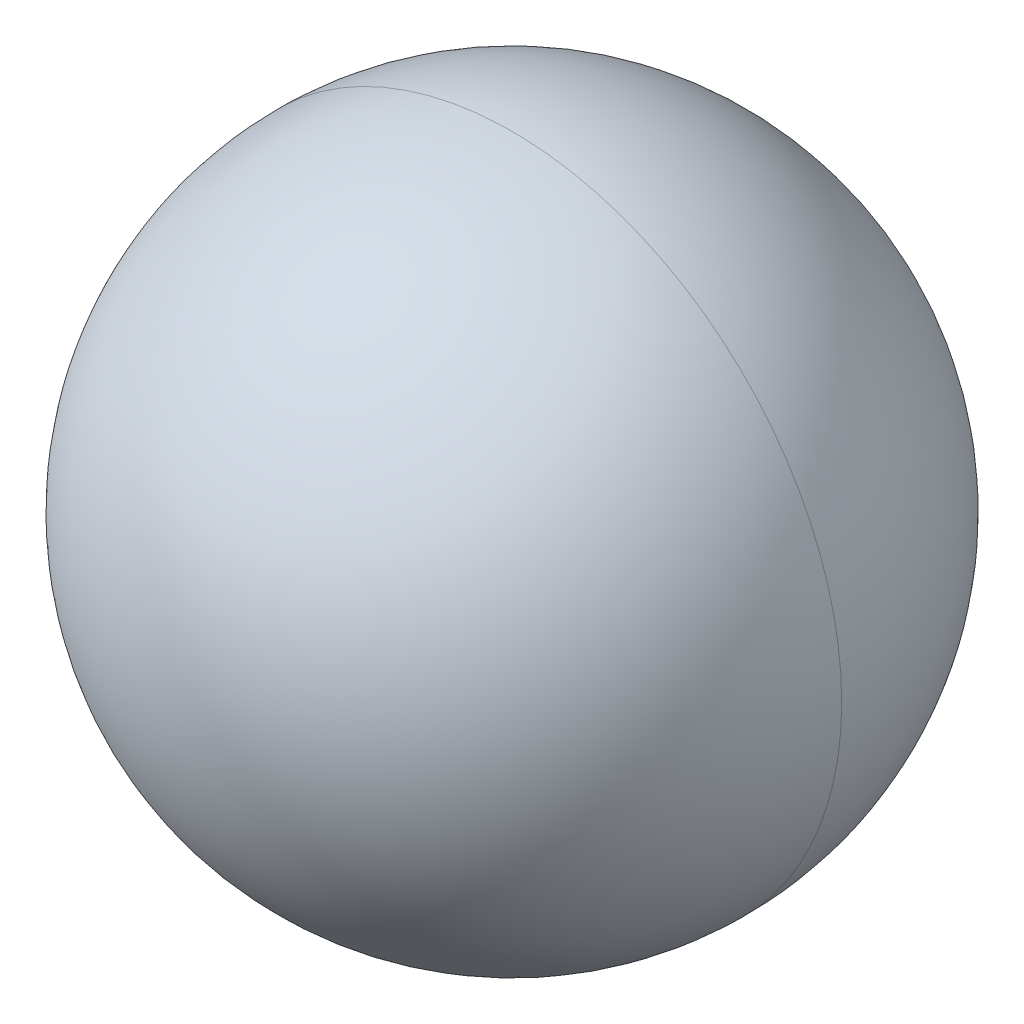
ISO-10303-21;
HEADER;
FILE_DESCRIPTION(('STEP AP214'),'2;1');
FILE_NAME('part.step','',(''),(''),'','','');
FILE_SCHEMA(('AUTOMOTIVE_DESIGN { 1 0 10303 214 1 1 1 1 }'));
ENDSEC;
DATA;
#1=APPLICATION_CONTEXT('core data for automotive mechanical design processes');
#2=APPLICATION_PROTOCOL_DEFINITION('international standard','automotive_design',2000,#1);
#3=PRODUCT_CONTEXT('',#1,'mechanical');
#4=PRODUCT('Part','Part','',(#3));
#5=PRODUCT_RELATED_PRODUCT_CATEGORY('part','',(#4));
#6=PRODUCT_DEFINITION_FORMATION('','',#4);
#7=PRODUCT_DEFINITION_CONTEXT('part definition',#1,'design');
#8=PRODUCT_DEFINITION('design','',#6,#7);
#9=PRODUCT_DEFINITION_SHAPE('','',#8);
#10=(LENGTH_UNIT() NAMED_UNIT(*) SI_UNIT(.MILLI.,.METRE.));
#11=(NAMED_UNIT(*) PLANE_ANGLE_UNIT() SI_UNIT($,.RADIAN.));
#12=(NAMED_UNIT(*) SI_UNIT($,.STERADIAN.) SOLID_ANGLE_UNIT());
#13=UNCERTAINTY_MEASURE_WITH_UNIT(LENGTH_MEASURE(1.E-05),#10,'distance_accuracy_value','');
#14=(GEOMETRIC_REPRESENTATION_CONTEXT(3) GLOBAL_UNCERTAINTY_ASSIGNED_CONTEXT((#13)) GLOBAL_UNIT_ASSIGNED_CONTEXT((#10,
#11,#12)) REPRESENTATION_CONTEXT('',''));
#15=CARTESIAN_POINT('',(0.,0.,0.));
#16=DIRECTION('',(0.,0.,1.));
#17=DIRECTION('',(1.,0.,0.));
#18=AXIS2_PLACEMENT_3D('',#15,#16,#17);
#19=CARTESIAN_POINT('',(1.75,4.95,0.));
#20=DIRECTION('',(1.,0.,0.));
#21=DIRECTION('',(0.,0.,-1.));
#22=AXIS2_PLACEMENT_3D('',#19,#20,#21);
#23=SPHERICAL_SURFACE('',#22,0.6);
#24=CARTESIAN_POINT('',(1.75,4.95,0.));
#25=DIRECTION('',(0.,0.,1.));
#26=DIRECTION('',(1.,0.,0.));
#27=AXIS2_PLACEMENT_3D('',#24,#25,#26);
#28=CIRCLE('',#27,0.6);
#29=CARTESIAN_POINT('',(2.35,4.95,0.));
#30=VERTEX_POINT('',#29);
#31=CARTESIAN_POINT('',(1.15,4.95,0.));
#32=VERTEX_POINT('',#31);
#33=EDGE_CURVE('E11',#30,#32,#28,.T.);
#34=ORIENTED_EDGE('',*,*,#33,.T.);
#35=CARTESIAN_POINT('',(1.75,4.95,0.));
#36=DIRECTION('',(0.,0.,-1.));
#37=DIRECTION('',(1.,0.,0.));
#38=AXIS2_PLACEMENT_3D('',#35,#36,#37);
#39=CIRCLE('',#38,0.6);
#40=EDGE_CURVE('E25',#30,#32,#39,.T.);
#41=ORIENTED_EDGE('',*,*,#40,.F.);
#42=EDGE_LOOP('',(#34,#41));
#43=FACE_BOUND('',#42,.T.);
#44=ADVANCED_FACE('F17',(#43),#23,.T.);
#45=CARTESIAN_POINT('',(1.75,4.95,0.));
#46=DIRECTION('',(1.,0.,0.));
#47=DIRECTION('',(0.,0.,1.));
#48=AXIS2_PLACEMENT_3D('',#45,#46,#47);
#49=SPHERICAL_SURFACE('',#48,0.6);
#50=ORIENTED_EDGE('',*,*,#33,.F.);
#51=ORIENTED_EDGE('',*,*,#40,.T.);
#52=EDGE_LOOP('',(#50,#51));
#53=FACE_BOUND('',#52,.T.);
#54=ADVANCED_FACE('F33',(#53),#49,.T.);
#55=CLOSED_SHELL('',(#44,#54));
#56=MANIFOLD_SOLID_BREP('B1',#55);
#57=ADVANCED_BREP_SHAPE_REPRESENTATION('',(#18,#56),#14);
#58=SHAPE_DEFINITION_REPRESENTATION(#9,#57);
ENDSEC;
END-ISO-10303-21;
